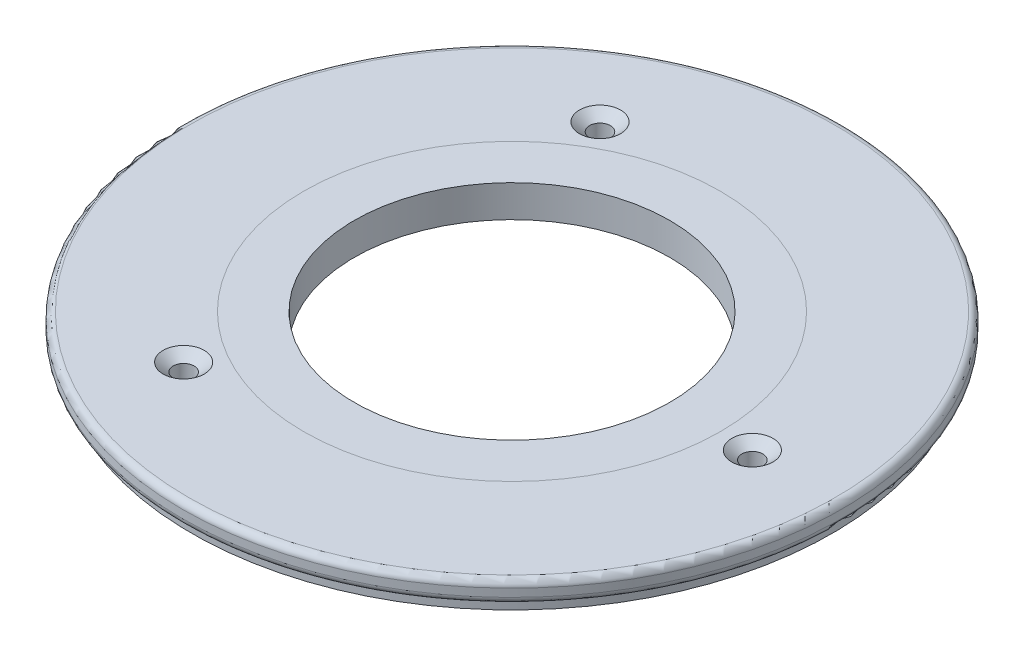
ISO-10303-21;
HEADER;
FILE_DESCRIPTION(('STEP AP214'),'2;1');
FILE_NAME('part.step','',(''),(''),'','','');
FILE_SCHEMA(('AUTOMOTIVE_DESIGN { 1 0 10303 214 1 1 1 1 }'));
ENDSEC;
DATA;
#1=APPLICATION_CONTEXT('core data for automotive mechanical design processes');
#2=APPLICATION_PROTOCOL_DEFINITION('international standard','automotive_design',2000,#1);
#3=PRODUCT_CONTEXT('',#1,'mechanical');
#4=PRODUCT('Part','Part','',(#3));
#5=PRODUCT_RELATED_PRODUCT_CATEGORY('part','',(#4));
#6=PRODUCT_DEFINITION_FORMATION('','',#4);
#7=PRODUCT_DEFINITION_CONTEXT('part definition',#1,'design');
#8=PRODUCT_DEFINITION('design','',#6,#7);
#9=PRODUCT_DEFINITION_SHAPE('','',#8);
#10=(LENGTH_UNIT() NAMED_UNIT(*) SI_UNIT(.MILLI.,.METRE.));
#11=(NAMED_UNIT(*) PLANE_ANGLE_UNIT() SI_UNIT($,.RADIAN.));
#12=(NAMED_UNIT(*) SI_UNIT($,.STERADIAN.) SOLID_ANGLE_UNIT());
#13=UNCERTAINTY_MEASURE_WITH_UNIT(LENGTH_MEASURE(1.E-05),#10,'distance_accuracy_value','');
#14=(GEOMETRIC_REPRESENTATION_CONTEXT(3) GLOBAL_UNCERTAINTY_ASSIGNED_CONTEXT((#13)) GLOBAL_UNIT_ASSIGNED_CONTEXT((#10,
#11,#12)) REPRESENTATION_CONTEXT('',''));
#15=CARTESIAN_POINT('',(0.,0.,0.));
#16=DIRECTION('',(0.,0.,1.));
#17=DIRECTION('',(1.,0.,0.));
#18=AXIS2_PLACEMENT_3D('',#15,#16,#17);
#19=CARTESIAN_POINT('',(0.,7.62,0.));
#20=DIRECTION('',(0.,1.,0.));
#21=DIRECTION('',(0.,0.,1.));
#22=AXIS2_PLACEMENT_3D('',#19,#20,#21);
#23=PLANE('',#22);
#24=CARTESIAN_POINT('',(57.15,7.62,0.));
#25=DIRECTION('',(0.,1.,0.));
#26=DIRECTION('',(0.,0.,1.));
#27=AXIS2_PLACEMENT_3D('',#24,#25,#26);
#28=CIRCLE('',#27,4.8895);
#29=CARTESIAN_POINT('',(57.15,7.62,4.8895));
#30=VERTEX_POINT('',#29);
#31=EDGE_CURVE('E94',#30,#30,#28,.T.);
#32=ORIENTED_EDGE('',*,*,#31,.F.);
#33=EDGE_LOOP('',(#32));
#34=FACE_BOUND('',#33,.T.);
#35=CARTESIAN_POINT('',(-28.5750000000002,7.62,-49.4933518262805));
#36=DIRECTION('',(0.,1.,0.));
#37=DIRECTION('',(0.,0.,1.));
#38=AXIS2_PLACEMENT_3D('',#35,#36,#37);
#39=CIRCLE('',#38,4.8895);
#40=CARTESIAN_POINT('',(-28.5750000000002,7.62,-44.6038518262805));
#41=VERTEX_POINT('',#40);
#42=EDGE_CURVE('E106',#41,#41,#39,.T.);
#43=ORIENTED_EDGE('',*,*,#42,.F.);
#44=EDGE_LOOP('',(#43));
#45=FACE_BOUND('',#44,.T.);
#46=CARTESIAN_POINT('',(-28.5749999999995,7.62,49.4933518262809));
#47=DIRECTION('',(0.,1.,0.));
#48=DIRECTION('',(0.,0.,1.));
#49=AXIS2_PLACEMENT_3D('',#46,#47,#48);
#50=CIRCLE('',#49,4.8895);
#51=CARTESIAN_POINT('',(-28.5749999999995,7.62,54.3828518262809));
#52=VERTEX_POINT('',#51);
#53=EDGE_CURVE('E118',#52,#52,#50,.T.);
#54=ORIENTED_EDGE('',*,*,#53,.F.);
#55=EDGE_LOOP('',(#54));
#56=FACE_BOUND('',#55,.T.);
#57=CARTESIAN_POINT('',(0.,7.62,0.));
#58=DIRECTION('',(0.,1.,0.));
#59=DIRECTION('',(0.,0.,1.));
#60=AXIS2_PLACEMENT_3D('',#57,#58,#59);
#61=CIRCLE('',#60,76.7715);
#62=CARTESIAN_POINT('',(0.,7.62,76.7715));
#63=VERTEX_POINT('',#62);
#64=EDGE_CURVE('E54',#63,#63,#61,.T.);
#65=ORIENTED_EDGE('',*,*,#64,.T.);
#66=EDGE_LOOP('',(#65));
#67=FACE_BOUND('',#66,.T.);
#68=CARTESIAN_POINT('',(0.,7.62,0.));
#69=DIRECTION('',(0.,1.,0.));
#70=DIRECTION('',(0.,0.,1.));
#71=AXIS2_PLACEMENT_3D('',#68,#69,#70);
#72=CIRCLE('',#71,49.53);
#73=CARTESIAN_POINT('',(0.,7.62,49.53));
#74=VERTEX_POINT('',#73);
#75=EDGE_CURVE('E10',#74,#74,#72,.F.);
#76=ORIENTED_EDGE('',*,*,#75,.T.);
#77=EDGE_LOOP('',(#76));
#78=FACE_BOUND('',#77,.T.);
#79=ADVANCED_FACE('F46',(#34,#45,#56,#67,#78),#23,.T.);
#80=CARTESIAN_POINT('',(0.,0.,0.));
#81=DIRECTION('',(0.,1.,0.));
#82=DIRECTION('',(0.,0.,1.));
#83=AXIS2_PLACEMENT_3D('',#80,#81,#82);
#84=PLANE('',#83);
#85=CARTESIAN_POINT('',(0.,0.,0.));
#86=DIRECTION('',(0.,1.,0.));
#87=DIRECTION('',(0.,0.,1.));
#88=AXIS2_PLACEMENT_3D('',#85,#86,#87);
#89=CIRCLE('',#88,37.5031);
#90=CARTESIAN_POINT('',(0.,0.,-37.5031));
#91=VERTEX_POINT('',#90);
#92=EDGE_CURVE('E79',#91,#91,#89,.T.);
#93=ORIENTED_EDGE('',*,*,#92,.T.);
#94=EDGE_LOOP('',(#93));
#95=FACE_BOUND('',#94,.T.);
#96=CARTESIAN_POINT('',(57.15,0.,0.));
#97=DIRECTION('',(0.,1.,0.));
#98=DIRECTION('',(0.,0.,1.));
#99=AXIS2_PLACEMENT_3D('',#96,#97,#98);
#100=CIRCLE('',#99,2.4892);
#101=CARTESIAN_POINT('',(57.15,0.,2.4892));
#102=VERTEX_POINT('',#101);
#103=EDGE_CURVE('E83',#102,#102,#100,.T.);
#104=ORIENTED_EDGE('',*,*,#103,.T.);
#105=EDGE_LOOP('',(#104));
#106=FACE_BOUND('',#105,.T.);
#107=CARTESIAN_POINT('',(-28.5750000000002,0.,-49.4933518262805));
#108=DIRECTION('',(0.,1.,0.));
#109=DIRECTION('',(0.,0.,1.));
#110=AXIS2_PLACEMENT_3D('',#107,#108,#109);
#111=CIRCLE('',#110,2.4892);
#112=CARTESIAN_POINT('',(-28.5750000000002,0.,-47.0041518262805));
#113=VERTEX_POINT('',#112);
#114=EDGE_CURVE('E98',#113,#113,#111,.T.);
#115=ORIENTED_EDGE('',*,*,#114,.T.);
#116=EDGE_LOOP('',(#115));
#117=FACE_BOUND('',#116,.T.);
#118=CARTESIAN_POINT('',(-28.5749999999995,0.,49.4933518262809));
#119=DIRECTION('',(0.,1.,0.));
#120=DIRECTION('',(0.,0.,1.));
#121=AXIS2_PLACEMENT_3D('',#118,#119,#120);
#122=CIRCLE('',#121,2.4892);
#123=CARTESIAN_POINT('',(-28.5749999999995,0.,51.9825518262809));
#124=VERTEX_POINT('',#123);
#125=EDGE_CURVE('E110',#124,#124,#122,.T.);
#126=ORIENTED_EDGE('',*,*,#125,.T.);
#127=EDGE_LOOP('',(#126));
#128=FACE_BOUND('',#127,.T.);
#129=CARTESIAN_POINT('',(0.,0.,0.));
#130=DIRECTION('',(0.,-1.,0.));
#131=DIRECTION('',(0.,0.,-1.));
#132=AXIS2_PLACEMENT_3D('',#129,#130,#131);
#133=CIRCLE('',#132,76.1746);
#134=CARTESIAN_POINT('',(0.,0.,-76.1746));
#135=VERTEX_POINT('',#134);
#136=EDGE_CURVE('E123',#135,#135,#133,.T.);
#137=ORIENTED_EDGE('',*,*,#136,.T.);
#138=EDGE_LOOP('',(#137));
#139=FACE_BOUND('',#138,.T.);
#140=ADVANCED_FACE('F151',(#95,#106,#117,#128,#139),#84,.F.);
#141=CARTESIAN_POINT('',(0.,7.62,0.));
#142=DIRECTION('',(0.,-1.,0.));
#143=DIRECTION('',(0.,0.,-1.));
#144=AXIS2_PLACEMENT_3D('',#141,#142,#143);
#145=CYLINDRICAL_SURFACE('',#144,78.359);
#146=CARTESIAN_POINT('',(0.,4.1275,0.));
#147=DIRECTION('',(0.,-1.,0.));
#148=DIRECTION('',(0.,0.,-1.));
#149=AXIS2_PLACEMENT_3D('',#146,#147,#148);
#150=CIRCLE('',#149,78.359);
#151=CARTESIAN_POINT('',(0.,4.1275,-78.359));
#152=VERTEX_POINT('',#151);
#153=EDGE_CURVE('E61',#152,#152,#150,.F.);
#154=CARTESIAN_POINT('',(0.,6.0325,0.));
#155=DIRECTION('',(0.,1.,0.));
#156=DIRECTION('',(0.,0.,1.));
#157=AXIS2_PLACEMENT_3D('',#154,#155,#156);
#158=CIRCLE('',#157,78.359);
#159=CARTESIAN_POINT('',(0.,6.0325,-78.359));
#160=VERTEX_POINT('',#159);
#161=EDGE_CURVE('E68',#160,#160,#158,.F.);
#162=CARTESIAN_POINT('',(0.,4.1275,-78.359));
#163=CARTESIAN_POINT('',(0.,4.14734375,-78.359));
#164=CARTESIAN_POINT('',(0.,4.1671875,-78.359));
#165=CARTESIAN_POINT('',(0.,4.206875,-78.359));
#166=CARTESIAN_POINT('',(0.,4.22671875,-78.359));
#167=CARTESIAN_POINT('',(0.,4.26640625,-78.359));
#168=CARTESIAN_POINT('',(0.,4.28625,-78.359));
#169=CARTESIAN_POINT('',(0.,4.3259375,-78.359));
#170=CARTESIAN_POINT('',(0.,4.34578125,-78.359));
#171=CARTESIAN_POINT('',(0.,4.38546875,-78.359));
#172=CARTESIAN_POINT('',(0.,4.4053125,-78.359));
#173=CARTESIAN_POINT('',(0.,4.445,-78.359));
#174=CARTESIAN_POINT('',(0.,4.46484375,-78.359));
#175=CARTESIAN_POINT('',(0.,4.50453125,-78.359));
#176=CARTESIAN_POINT('',(0.,4.524375,-78.359));
#177=CARTESIAN_POINT('',(0.,4.5640625,-78.359));
#178=CARTESIAN_POINT('',(0.,4.58390625,-78.359));
#179=CARTESIAN_POINT('',(0.,4.62359375,-78.359));
#180=CARTESIAN_POINT('',(0.,4.6434375,-78.359));
#181=CARTESIAN_POINT('',(0.,4.683125,-78.359));
#182=CARTESIAN_POINT('',(0.,4.70296875,-78.359));
#183=CARTESIAN_POINT('',(0.,4.74265625,-78.359));
#184=CARTESIAN_POINT('',(0.,4.7625,-78.359));
#185=CARTESIAN_POINT('',(0.,4.8021875,-78.359));
#186=CARTESIAN_POINT('',(0.,4.82203125,-78.359));
#187=CARTESIAN_POINT('',(0.,4.86171875,-78.359));
#188=CARTESIAN_POINT('',(0.,4.8815625,-78.359));
#189=CARTESIAN_POINT('',(0.,4.92125,-78.359));
#190=CARTESIAN_POINT('',(0.,4.94109375,-78.359));
#191=CARTESIAN_POINT('',(0.,4.98078125,-78.359));
#192=CARTESIAN_POINT('',(0.,5.000625,-78.359));
#193=CARTESIAN_POINT('',(0.,5.0403125,-78.359));
#194=CARTESIAN_POINT('',(0.,5.06015625,-78.359));
#195=CARTESIAN_POINT('',(0.,5.09984375,-78.359));
#196=CARTESIAN_POINT('',(0.,5.1196875,-78.359));
#197=CARTESIAN_POINT('',(0.,5.159375,-78.359));
#198=CARTESIAN_POINT('',(0.,5.17921875,-78.359));
#199=CARTESIAN_POINT('',(0.,5.21890625,-78.359));
#200=CARTESIAN_POINT('',(0.,5.23875,-78.359));
#201=CARTESIAN_POINT('',(0.,5.2784375,-78.359));
#202=CARTESIAN_POINT('',(0.,5.29828125,-78.359));
#203=CARTESIAN_POINT('',(0.,5.33796875,-78.359));
#204=CARTESIAN_POINT('',(0.,5.3578125,-78.359));
#205=CARTESIAN_POINT('',(0.,5.3975,-78.359));
#206=CARTESIAN_POINT('',(0.,5.41734375,-78.359));
#207=CARTESIAN_POINT('',(0.,5.45703125,-78.359));
#208=CARTESIAN_POINT('',(0.,5.476875,-78.359));
#209=CARTESIAN_POINT('',(0.,5.5165625,-78.359));
#210=CARTESIAN_POINT('',(0.,5.53640625,-78.359));
#211=CARTESIAN_POINT('',(0.,5.57609375,-78.359));
#212=CARTESIAN_POINT('',(0.,5.5959375,-78.359));
#213=CARTESIAN_POINT('',(0.,5.635625,-78.359));
#214=CARTESIAN_POINT('',(0.,5.65546875,-78.359));
#215=CARTESIAN_POINT('',(0.,5.69515625,-78.359));
#216=CARTESIAN_POINT('',(0.,5.715,-78.359));
#217=CARTESIAN_POINT('',(0.,5.7546875,-78.359));
#218=CARTESIAN_POINT('',(0.,5.77453125,-78.359));
#219=CARTESIAN_POINT('',(0.,5.81421875,-78.359));
#220=CARTESIAN_POINT('',(0.,5.8340625,-78.359));
#221=CARTESIAN_POINT('',(0.,5.87375,-78.359));
#222=CARTESIAN_POINT('',(0.,5.89359375,-78.359));
#223=CARTESIAN_POINT('',(0.,5.93328125,-78.359));
#224=CARTESIAN_POINT('',(0.,5.953125,-78.359));
#225=CARTESIAN_POINT('',(0.,5.9928125,-78.359));
#226=CARTESIAN_POINT('',(0.,6.01265625,-78.359));
#227=CARTESIAN_POINT('',(0.,6.0325,-78.359));
#228=B_SPLINE_CURVE_WITH_KNOTS('',3,(#162,#163,#164,#165,#166,#167,#168,#169,#170,#171,#172,
#173,#174,#175,#176,#177,#178,#179,#180,#181,#182,#183,#184,#185,#186,#187,#188,#189,#190,#191,
#192,#193,#194,#195,#196,#197,#198,#199,#200,#201,#202,#203,#204,#205,#206,#207,#208,#209,#210,
#211,#212,#213,#214,#215,#216,#217,#218,#219,#220,#221,#222,#223,#224,#225,#226,#227),
.UNSPECIFIED.,.F.,.F.,(4,2,2,2,2,2,2,2,2,2,2,2,2,2,2,2,2,2,2,2,2,2,2,2,2,2,2,2,2,2,2,2,4),(0.,
0.0595312499999997,0.119062499999999,0.178593749999999,0.238124999999999,0.297656249999999,
0.3571875,0.41671875,0.476249999999999,0.535781249999999,0.595312499999999,0.654843749999999,
0.714375,0.773906249999999,0.833437499999999,0.892968749999999,0.952499999999998,1.01203125,
1.0715625,1.13109375,1.190625,1.25015625,1.3096875,1.36921875,1.42875,1.48828125,1.5478125,
1.60734375,1.666875,1.72640625,1.7859375,1.84546875,1.905),.UNSPECIFIED.);
#229=EDGE_CURVE('BSEAM158',#152,#160,#228,.T.);
#230=ORIENTED_EDGE('',*,*,#153,.T.);
#231=ORIENTED_EDGE('',*,*,#161,.T.);
#232=ORIENTED_EDGE('',*,*,#229,.T.);
#233=ORIENTED_EDGE('',*,*,#229,.F.);
#234=EDGE_LOOP('',(#230,#232,#231,#233));
#235=FACE_BOUND('',#234,.T.);
#236=ADVANCED_FACE('F158',(#235),#145,.T.);
#237=ORIENTED_EDGE('',*,*,#75,.F.);
#238=EDGE_LOOP('',(#237));
#239=FACE_BOUND('',#238,.T.);
#240=CARTESIAN_POINT('',(0.,7.62,0.));
#241=DIRECTION('',(0.,1.,0.));
#242=DIRECTION('',(0.,0.,1.));
#243=AXIS2_PLACEMENT_3D('',#240,#241,#242);
#244=CIRCLE('',#243,37.5031);
#245=CARTESIAN_POINT('',(0.,7.62,-37.5031));
#246=VERTEX_POINT('',#245);
#247=EDGE_CURVE('E78',#246,#246,#244,.T.);
#248=ORIENTED_EDGE('',*,*,#247,.F.);
#249=EDGE_LOOP('',(#248));
#250=FACE_BOUND('',#249,.T.);
#251=ADVANCED_FACE('F154',(#239,#250),#23,.T.);
#252=CARTESIAN_POINT('',(0.,7.62,0.));
#253=DIRECTION('',(0.,-1.,0.));
#254=DIRECTION('',(0.,0.,-1.));
#255=AXIS2_PLACEMENT_3D('',#252,#253,#254);
#256=CYLINDRICAL_SURFACE('',#255,37.5031);
#257=CARTESIAN_POINT('',(0.,7.62,-37.5031));
#258=CARTESIAN_POINT('',(0.,7.540625,-37.5031));
#259=CARTESIAN_POINT('',(0.,7.46125,-37.5031));
#260=CARTESIAN_POINT('',(0.,7.3025,-37.5031));
#261=CARTESIAN_POINT('',(0.,7.223125,-37.5031));
#262=CARTESIAN_POINT('',(0.,7.064375,-37.5031));
#263=CARTESIAN_POINT('',(0.,6.985,-37.5031));
#264=CARTESIAN_POINT('',(0.,6.82625,-37.5031));
#265=CARTESIAN_POINT('',(0.,6.746875,-37.5031));
#266=CARTESIAN_POINT('',(0.,6.588125,-37.5031));
#267=CARTESIAN_POINT('',(0.,6.50875,-37.5031));
#268=CARTESIAN_POINT('',(0.,6.35,-37.5031));
#269=CARTESIAN_POINT('',(0.,6.270625,-37.5031));
#270=CARTESIAN_POINT('',(0.,6.111875,-37.5031));
#271=CARTESIAN_POINT('',(0.,6.0325,-37.5031));
#272=CARTESIAN_POINT('',(0.,5.87375,-37.5031));
#273=CARTESIAN_POINT('',(0.,5.794375,-37.5031));
#274=CARTESIAN_POINT('',(0.,5.635625,-37.5031));
#275=CARTESIAN_POINT('',(0.,5.55625,-37.5031));
#276=CARTESIAN_POINT('',(0.,5.3975,-37.5031));
#277=CARTESIAN_POINT('',(0.,5.318125,-37.5031));
#278=CARTESIAN_POINT('',(0.,5.159375,-37.5031));
#279=CARTESIAN_POINT('',(0.,5.08,-37.5031));
#280=CARTESIAN_POINT('',(0.,4.92125,-37.5031));
#281=CARTESIAN_POINT('',(0.,4.841875,-37.5031));
#282=CARTESIAN_POINT('',(0.,4.683125,-37.5031));
#283=CARTESIAN_POINT('',(0.,4.60375,-37.5031));
#284=CARTESIAN_POINT('',(0.,4.445,-37.5031));
#285=CARTESIAN_POINT('',(0.,4.365625,-37.5031));
#286=CARTESIAN_POINT('',(0.,4.206875,-37.5031));
#287=CARTESIAN_POINT('',(0.,4.1275,-37.5031));
#288=CARTESIAN_POINT('',(0.,3.96875,-37.5031));
#289=CARTESIAN_POINT('',(0.,3.889375,-37.5031));
#290=CARTESIAN_POINT('',(0.,3.730625,-37.5031));
#291=CARTESIAN_POINT('',(0.,3.65125,-37.5031));
#292=CARTESIAN_POINT('',(0.,3.4925,-37.5031));
#293=CARTESIAN_POINT('',(0.,3.413125,-37.5031));
#294=CARTESIAN_POINT('',(0.,3.254375,-37.5031));
#295=CARTESIAN_POINT('',(0.,3.175,-37.5031));
#296=CARTESIAN_POINT('',(0.,3.01625,-37.5031));
#297=CARTESIAN_POINT('',(0.,2.936875,-37.5031));
#298=CARTESIAN_POINT('',(0.,2.778125,-37.5031));
#299=CARTESIAN_POINT('',(0.,2.69875,-37.5031));
#300=CARTESIAN_POINT('',(0.,2.54,-37.5031));
#301=CARTESIAN_POINT('',(0.,2.460625,-37.5031));
#302=CARTESIAN_POINT('',(0.,2.301875,-37.5031));
#303=CARTESIAN_POINT('',(0.,2.2225,-37.5031));
#304=CARTESIAN_POINT('',(0.,2.06375,-37.5031));
#305=CARTESIAN_POINT('',(0.,1.984375,-37.5031));
#306=CARTESIAN_POINT('',(0.,1.825625,-37.5031));
#307=CARTESIAN_POINT('',(0.,1.74625,-37.5031));
#308=CARTESIAN_POINT('',(0.,1.5875,-37.5031));
#309=CARTESIAN_POINT('',(0.,1.508125,-37.5031));
#310=CARTESIAN_POINT('',(0.,1.349375,-37.5031));
#311=CARTESIAN_POINT('',(0.,1.27,-37.5031));
#312=CARTESIAN_POINT('',(0.,1.11125,-37.5031));
#313=CARTESIAN_POINT('',(0.,1.031875,-37.5031));
#314=CARTESIAN_POINT('',(0.,0.873125,-37.5031));
#315=CARTESIAN_POINT('',(0.,0.79375,-37.5031));
#316=CARTESIAN_POINT('',(0.,0.635,-37.5031));
#317=CARTESIAN_POINT('',(0.,0.555625,-37.5031));
#318=CARTESIAN_POINT('',(0.,0.396875,-37.5031));
#319=CARTESIAN_POINT('',(0.,0.3175,-37.5031));
#320=CARTESIAN_POINT('',(0.,0.15875,-37.5031));
#321=CARTESIAN_POINT('',(0.,0.0793749999999999,-37.5031));
#322=CARTESIAN_POINT('',(0.,0.,-37.5031));
#323=B_SPLINE_CURVE_WITH_KNOTS('',3,(#257,#258,#259,#260,#261,#262,#263,#264,#265,#266,#267,
#268,#269,#270,#271,#272,#273,#274,#275,#276,#277,#278,#279,#280,#281,#282,#283,#284,#285,#286,
#287,#288,#289,#290,#291,#292,#293,#294,#295,#296,#297,#298,#299,#300,#301,#302,#303,#304,#305,
#306,#307,#308,#309,#310,#311,#312,#313,#314,#315,#316,#317,#318,#319,#320,#321,#322),
.UNSPECIFIED.,.F.,.F.,(4,2,2,2,2,2,2,2,2,2,2,2,2,2,2,2,2,2,2,2,2,2,2,2,2,2,2,2,2,2,2,2,4),(0.,
0.238125,0.47625,0.714375000000001,0.9525,1.190625,1.42875,1.666875,1.905,2.143125,2.38125,
2.619375,2.8575,3.095625,3.33375,3.571875,3.81,4.048125,4.28625,4.524375,4.7625,5.000625,
5.23875,5.476875,5.715,5.953125,6.19125,6.429375,6.6675,6.905625,7.14375,7.381875,7.62),.UNSPECIFIED.);
#324=EDGE_CURVE('BSEAM165',#246,#91,#323,.T.);
#325=ORIENTED_EDGE('',*,*,#247,.T.);
#326=ORIENTED_EDGE('',*,*,#92,.F.);
#327=ORIENTED_EDGE('',*,*,#324,.T.);
#328=ORIENTED_EDGE('',*,*,#324,.F.);
#329=EDGE_LOOP('',(#325,#327,#326,#328));
#330=FACE_BOUND('',#329,.T.);
#331=ADVANCED_FACE('F165',(#330),#256,.F.);
#332=CARTESIAN_POINT('',(57.15,7.62,0.));
#333=DIRECTION('',(0.,1.,0.));
#334=DIRECTION('',(0.,0.,1.));
#335=AXIS2_PLACEMENT_3D('',#332,#333,#334);
#336=CYLINDRICAL_SURFACE('',#335,2.4892);
#337=ORIENTED_EDGE('',*,*,#103,.F.);
#338=EDGE_LOOP('',(#337));
#339=FACE_BOUND('',#338,.T.);
#340=CARTESIAN_POINT('',(57.15,5.60590915528517,0.));
#341=DIRECTION('',(0.,1.,0.));
#342=DIRECTION('',(0.,0.,1.));
#343=AXIS2_PLACEMENT_3D('',#340,#341,#342);
#344=CIRCLE('',#343,2.4892);
#345=CARTESIAN_POINT('',(57.15,5.60590915528517,2.4892));
#346=VERTEX_POINT('',#345);
#347=EDGE_CURVE('E90',#346,#346,#344,.T.);
#348=ORIENTED_EDGE('',*,*,#347,.T.);
#349=EDGE_LOOP('',(#348));
#350=FACE_BOUND('',#349,.T.);
#351=ADVANCED_FACE('F171',(#339,#350),#336,.F.);
#352=CARTESIAN_POINT('',(57.15,7.62,0.));
#353=DIRECTION('',(0.,1.,0.));
#354=DIRECTION('',(0.,0.,1.));
#355=AXIS2_PLACEMENT_3D('',#352,#353,#354);
#356=CONICAL_SURFACE('',#355,4.8895,0.872664625997164);
#357=ORIENTED_EDGE('',*,*,#347,.F.);
#358=EDGE_LOOP('',(#357));
#359=FACE_BOUND('',#358,.T.);
#360=ORIENTED_EDGE('',*,*,#31,.T.);
#361=EDGE_LOOP('',(#360));
#362=FACE_BOUND('',#361,.T.);
#363=ADVANCED_FACE('F205',(#359,#362),#356,.F.);
#364=CARTESIAN_POINT('',(-28.5750000000002,7.62,-49.4933518262805));
#365=DIRECTION('',(0.,1.,0.));
#366=DIRECTION('',(0.,0.,1.));
#367=AXIS2_PLACEMENT_3D('',#364,#365,#366);
#368=CYLINDRICAL_SURFACE('',#367,2.4892);
#369=ORIENTED_EDGE('',*,*,#114,.F.);
#370=EDGE_LOOP('',(#369));
#371=FACE_BOUND('',#370,.T.);
#372=CARTESIAN_POINT('',(-28.5750000000002,5.60590915528517,-49.4933518262805));
#373=DIRECTION('',(0.,1.,0.));
#374=DIRECTION('',(0.,0.,1.));
#375=AXIS2_PLACEMENT_3D('',#372,#373,#374);
#376=CIRCLE('',#375,2.4892);
#377=CARTESIAN_POINT('',(-28.5750000000002,5.60590915528517,-47.0041518262805));
#378=VERTEX_POINT('',#377);
#379=EDGE_CURVE('E102',#378,#378,#376,.T.);
#380=ORIENTED_EDGE('',*,*,#379,.T.);
#381=EDGE_LOOP('',(#380));
#382=FACE_BOUND('',#381,.T.);
#383=ADVANCED_FACE('F199',(#371,#382),#368,.F.);
#384=CARTESIAN_POINT('',(-28.5750000000002,7.62,-49.4933518262805));
#385=DIRECTION('',(0.,1.,0.));
#386=DIRECTION('',(0.,0.,1.));
#387=AXIS2_PLACEMENT_3D('',#384,#385,#386);
#388=CONICAL_SURFACE('',#387,4.8895,0.872664625997164);
#389=ORIENTED_EDGE('',*,*,#379,.F.);
#390=EDGE_LOOP('',(#389));
#391=FACE_BOUND('',#390,.T.);
#392=ORIENTED_EDGE('',*,*,#42,.T.);
#393=EDGE_LOOP('',(#392));
#394=FACE_BOUND('',#393,.T.);
#395=ADVANCED_FACE('F190',(#391,#394),#388,.F.);
#396=CARTESIAN_POINT('',(-28.5749999999995,7.62,49.4933518262809));
#397=DIRECTION('',(0.,1.,0.));
#398=DIRECTION('',(0.,0.,1.));
#399=AXIS2_PLACEMENT_3D('',#396,#397,#398);
#400=CYLINDRICAL_SURFACE('',#399,2.4892);
#401=ORIENTED_EDGE('',*,*,#125,.F.);
#402=EDGE_LOOP('',(#401));
#403=FACE_BOUND('',#402,.T.);
#404=CARTESIAN_POINT('',(-28.5749999999995,5.60590915528517,49.4933518262809));
#405=DIRECTION('',(0.,1.,0.));
#406=DIRECTION('',(0.,0.,1.));
#407=AXIS2_PLACEMENT_3D('',#404,#405,#406);
#408=CIRCLE('',#407,2.4892);
#409=CARTESIAN_POINT('',(-28.5749999999995,5.60590915528517,51.9825518262809));
#410=VERTEX_POINT('',#409);
#411=EDGE_CURVE('E114',#410,#410,#408,.T.);
#412=ORIENTED_EDGE('',*,*,#411,.T.);
#413=EDGE_LOOP('',(#412));
#414=FACE_BOUND('',#413,.T.);
#415=ADVANCED_FACE('F147',(#403,#414),#400,.F.);
#416=CARTESIAN_POINT('',(-28.5749999999995,7.62,49.4933518262809));
#417=DIRECTION('',(0.,1.,0.));
#418=DIRECTION('',(0.,0.,1.));
#419=AXIS2_PLACEMENT_3D('',#416,#417,#418);
#420=CONICAL_SURFACE('',#419,4.8895,0.872664625997164);
#421=ORIENTED_EDGE('',*,*,#411,.F.);
#422=EDGE_LOOP('',(#421));
#423=FACE_BOUND('',#422,.T.);
#424=ORIENTED_EDGE('',*,*,#53,.T.);
#425=EDGE_LOOP('',(#424));
#426=FACE_BOUND('',#425,.T.);
#427=ADVANCED_FACE('F138',(#423,#426),#420,.F.);
#428=CARTESIAN_POINT('',(0.,2.54,0.));
#429=DIRECTION('',(0.,-1.,0.));
#430=DIRECTION('',(0.,0.,-1.));
#431=AXIS2_PLACEMENT_3D('',#428,#429,#430);
#432=PLANE('',#431);
#433=CARTESIAN_POINT('',(0.,2.54,0.));
#434=DIRECTION('',(0.,-1.,0.));
#435=DIRECTION('',(0.,0.,-1.));
#436=AXIS2_PLACEMENT_3D('',#433,#434,#435);
#437=CIRCLE('',#436,76.7715);
#438=CARTESIAN_POINT('',(0.,2.54,-76.7715));
#439=VERTEX_POINT('',#438);
#440=EDGE_CURVE('E74',#439,#439,#437,.T.);
#441=ORIENTED_EDGE('',*,*,#440,.T.);
#442=EDGE_LOOP('',(#441));
#443=FACE_BOUND('',#442,.T.);
#444=CARTESIAN_POINT('',(0.,2.54,0.));
#445=DIRECTION('',(0.,-1.,0.));
#446=DIRECTION('',(0.,0.,-1.));
#447=AXIS2_PLACEMENT_3D('',#444,#445,#446);
#448=CIRCLE('',#447,76.1746);
#449=CARTESIAN_POINT('',(0.,2.54,-76.1746));
#450=VERTEX_POINT('',#449);
#451=EDGE_CURVE('E122',#450,#450,#448,.T.);
#452=ORIENTED_EDGE('',*,*,#451,.F.);
#453=EDGE_LOOP('',(#452));
#454=FACE_BOUND('',#453,.T.);
#455=ADVANCED_FACE('F136',(#443,#454),#432,.T.);
#456=CARTESIAN_POINT('',(0.,2.54,0.));
#457=DIRECTION('',(0.,-1.,0.));
#458=DIRECTION('',(0.,0.,-1.));
#459=AXIS2_PLACEMENT_3D('',#456,#457,#458);
#460=CYLINDRICAL_SURFACE('',#459,76.1746);
#461=ORIENTED_EDGE('',*,*,#451,.T.);
#462=EDGE_LOOP('',(#461));
#463=FACE_BOUND('',#462,.T.);
#464=ORIENTED_EDGE('',*,*,#136,.F.);
#465=EDGE_LOOP('',(#464));
#466=FACE_BOUND('',#465,.T.);
#467=ADVANCED_FACE('F133',(#463,#466),#460,.T.);
#468=CARTESIAN_POINT('',(0.,4.1275,0.));
#469=DIRECTION('',(0.,-1.,0.));
#470=DIRECTION('',(0.,0.,-1.));
#471=AXIS2_PLACEMENT_3D('',#468,#469,#470);
#472=TOROIDAL_SURFACE('',#471,76.7715,1.5875);
#473=ORIENTED_EDGE('',*,*,#153,.F.);
#474=EDGE_LOOP('',(#473));
#475=FACE_BOUND('',#474,.T.);
#476=ORIENTED_EDGE('',*,*,#440,.F.);
#477=EDGE_LOOP('',(#476));
#478=FACE_BOUND('',#477,.T.);
#479=ADVANCED_FACE('F145',(#475,#478),#472,.T.);
#480=CARTESIAN_POINT('',(0.,6.0325,0.));
#481=DIRECTION('',(0.,1.,0.));
#482=DIRECTION('',(0.,0.,1.));
#483=AXIS2_PLACEMENT_3D('',#480,#481,#482);
#484=TOROIDAL_SURFACE('',#483,76.7715,1.5875);
#485=ORIENTED_EDGE('',*,*,#161,.F.);
#486=EDGE_LOOP('',(#485));
#487=FACE_BOUND('',#486,.T.);
#488=ORIENTED_EDGE('',*,*,#64,.F.);
#489=EDGE_LOOP('',(#488));
#490=FACE_BOUND('',#489,.T.);
#491=ADVANCED_FACE('F48',(#487,#490),#484,.T.);
#492=CLOSED_SHELL('',(#79,#140,#236,#251,#331,#351,#363,#383,#395,#415,#427,#455,#467,#479,#491));
#493=MANIFOLD_SOLID_BREP('B2',#492);
#494=ADVANCED_BREP_SHAPE_REPRESENTATION('',(#18,#493),#14);
#495=SHAPE_DEFINITION_REPRESENTATION(#9,#494);
ENDSEC;
END-ISO-10303-21;
